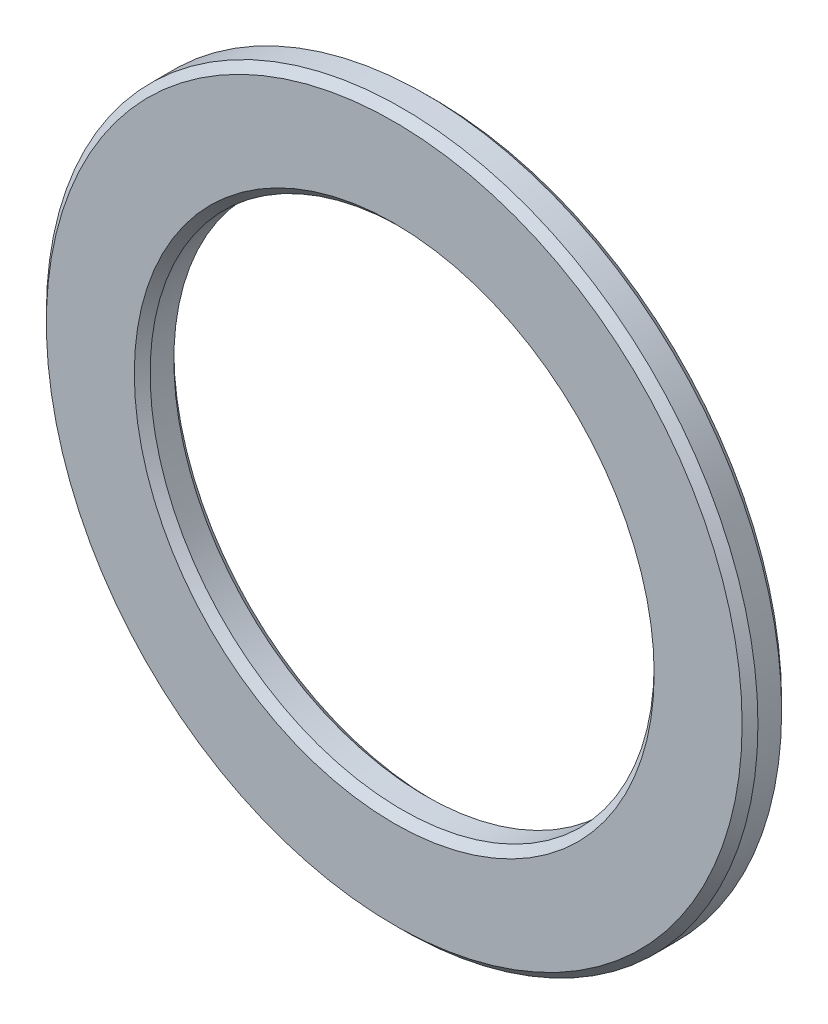
ISO-10303-21;
HEADER;
FILE_DESCRIPTION(('STEP AP214'),'2;1');
FILE_NAME('part.step','',(''),(''),'','','');
FILE_SCHEMA(('AUTOMOTIVE_DESIGN { 1 0 10303 214 1 1 1 1 }'));
ENDSEC;
DATA;
#1=APPLICATION_CONTEXT('core data for automotive mechanical design processes');
#2=APPLICATION_PROTOCOL_DEFINITION('international standard','automotive_design',2000,#1);
#3=PRODUCT_CONTEXT('',#1,'mechanical');
#4=PRODUCT('Part','Part','',(#3));
#5=PRODUCT_RELATED_PRODUCT_CATEGORY('part','',(#4));
#6=PRODUCT_DEFINITION_FORMATION('','',#4);
#7=PRODUCT_DEFINITION_CONTEXT('part definition',#1,'design');
#8=PRODUCT_DEFINITION('design','',#6,#7);
#9=PRODUCT_DEFINITION_SHAPE('','',#8);
#10=(LENGTH_UNIT() NAMED_UNIT(*) SI_UNIT(.MILLI.,.METRE.));
#11=(NAMED_UNIT(*) PLANE_ANGLE_UNIT() SI_UNIT($,.RADIAN.));
#12=(NAMED_UNIT(*) SI_UNIT($,.STERADIAN.) SOLID_ANGLE_UNIT());
#13=UNCERTAINTY_MEASURE_WITH_UNIT(LENGTH_MEASURE(1.E-05),#10,'distance_accuracy_value','');
#14=(GEOMETRIC_REPRESENTATION_CONTEXT(3) GLOBAL_UNCERTAINTY_ASSIGNED_CONTEXT((#13)) GLOBAL_UNIT_ASSIGNED_CONTEXT((#10,
#11,#12)) REPRESENTATION_CONTEXT('',''));
#15=CARTESIAN_POINT('',(0.,0.,0.));
#16=DIRECTION('',(0.,0.,1.));
#17=DIRECTION('',(1.,0.,0.));
#18=AXIS2_PLACEMENT_3D('',#15,#16,#17);
#19=CARTESIAN_POINT('',(0.,0.,1.));
#20=DIRECTION('',(0.,0.,1.));
#21=DIRECTION('',(1.,0.,0.));
#22=AXIS2_PLACEMENT_3D('',#19,#20,#21);
#23=PLANE('',#22);
#24=CARTESIAN_POINT('',(0.,0.,1.));
#25=DIRECTION('',(0.,0.,1.));
#26=DIRECTION('',(1.,0.,0.));
#27=AXIS2_PLACEMENT_3D('',#24,#25,#26);
#28=CIRCLE('',#27,17.6);
#29=CARTESIAN_POINT('',(17.6,0.,1.));
#30=VERTEX_POINT('',#29);
#31=EDGE_CURVE('E42',#30,#30,#28,.T.);
#32=ORIENTED_EDGE('',*,*,#31,.T.);
#33=EDGE_LOOP('',(#32));
#34=FACE_BOUND('',#33,.T.);
#35=CARTESIAN_POINT('',(0.,0.,1.));
#36=DIRECTION('',(0.,0.,1.));
#37=DIRECTION('',(1.,0.,0.));
#38=AXIS2_PLACEMENT_3D('',#35,#36,#37);
#39=CIRCLE('',#38,13.15);
#40=CARTESIAN_POINT('',(13.15,0.,1.));
#41=VERTEX_POINT('',#40);
#42=EDGE_CURVE('E46',#41,#41,#39,.F.);
#43=ORIENTED_EDGE('',*,*,#42,.T.);
#44=EDGE_LOOP('',(#43));
#45=FACE_BOUND('',#44,.T.);
#46=ADVANCED_FACE('F31',(#34,#45),#23,.T.);
#47=CARTESIAN_POINT('',(0.,0.,-1.));
#48=DIRECTION('',(0.,0.,1.));
#49=DIRECTION('',(1.,0.,0.));
#50=AXIS2_PLACEMENT_3D('',#47,#48,#49);
#51=PLANE('',#50);
#52=CARTESIAN_POINT('',(0.,0.,-1.));
#53=DIRECTION('',(0.,0.,1.));
#54=DIRECTION('',(1.,0.,0.));
#55=AXIS2_PLACEMENT_3D('',#52,#53,#54);
#56=CIRCLE('',#55,17.6);
#57=CARTESIAN_POINT('',(17.6,0.,-1.));
#58=VERTEX_POINT('',#57);
#59=EDGE_CURVE('E51',#58,#58,#56,.F.);
#60=ORIENTED_EDGE('',*,*,#59,.T.);
#61=EDGE_LOOP('',(#60));
#62=FACE_BOUND('',#61,.T.);
#63=CARTESIAN_POINT('',(0.,0.,-1.));
#64=DIRECTION('',(0.,0.,1.));
#65=DIRECTION('',(1.,0.,0.));
#66=AXIS2_PLACEMENT_3D('',#63,#64,#65);
#67=CIRCLE('',#66,13.15);
#68=CARTESIAN_POINT('',(13.15,0.,-1.));
#69=VERTEX_POINT('',#68);
#70=EDGE_CURVE('E54',#69,#69,#67,.T.);
#71=ORIENTED_EDGE('',*,*,#70,.T.);
#72=EDGE_LOOP('',(#71));
#73=FACE_BOUND('',#72,.T.);
#74=ADVANCED_FACE('F76',(#62,#73),#51,.F.);
#75=CARTESIAN_POINT('',(0.,0.,1.));
#76=DIRECTION('',(0.,0.,-1.));
#77=DIRECTION('',(-1.,0.,0.));
#78=AXIS2_PLACEMENT_3D('',#75,#76,#77);
#79=CYLINDRICAL_SURFACE('',#78,18.);
#80=CARTESIAN_POINT('',(0.,0.,-0.599999999999996));
#81=DIRECTION('',(0.,0.,1.));
#82=DIRECTION('',(1.,0.,0.));
#83=AXIS2_PLACEMENT_3D('',#80,#81,#82);
#84=CIRCLE('',#83,18.);
#85=CARTESIAN_POINT('',(18.,0.,-0.599999999999996));
#86=VERTEX_POINT('',#85);
#87=EDGE_CURVE('E57',#86,#86,#84,.T.);
#88=ORIENTED_EDGE('',*,*,#87,.T.);
#89=EDGE_LOOP('',(#88));
#90=FACE_BOUND('',#89,.T.);
#91=CARTESIAN_POINT('',(0.,0.,0.599999999999999));
#92=DIRECTION('',(0.,0.,1.));
#93=DIRECTION('',(1.,0.,0.));
#94=AXIS2_PLACEMENT_3D('',#91,#92,#93);
#95=CIRCLE('',#94,18.);
#96=CARTESIAN_POINT('',(18.,0.,0.599999999999999));
#97=VERTEX_POINT('',#96);
#98=EDGE_CURVE('E60',#97,#97,#95,.F.);
#99=ORIENTED_EDGE('',*,*,#98,.T.);
#100=EDGE_LOOP('',(#99));
#101=FACE_BOUND('',#100,.T.);
#102=ADVANCED_FACE('F64',(#90,#101),#79,.T.);
#103=CARTESIAN_POINT('',(0.,0.,1.));
#104=DIRECTION('',(0.,0.,-1.));
#105=DIRECTION('',(-1.,0.,0.));
#106=AXIS2_PLACEMENT_3D('',#103,#104,#105);
#107=CYLINDRICAL_SURFACE('',#106,12.75);
#108=CARTESIAN_POINT('',(0.,0.,-0.600000000000008));
#109=DIRECTION('',(0.,0.,1.));
#110=DIRECTION('',(1.,0.,0.));
#111=AXIS2_PLACEMENT_3D('',#108,#109,#110);
#112=CIRCLE('',#111,12.75);
#113=CARTESIAN_POINT('',(12.75,0.,-0.600000000000008));
#114=VERTEX_POINT('',#113);
#115=EDGE_CURVE('E10',#114,#114,#112,.F.);
#116=ORIENTED_EDGE('',*,*,#115,.T.);
#117=EDGE_LOOP('',(#116));
#118=FACE_BOUND('',#117,.T.);
#119=CARTESIAN_POINT('',(0.,0.,0.599999999999997));
#120=DIRECTION('',(0.,0.,1.));
#121=DIRECTION('',(1.,0.,0.));
#122=AXIS2_PLACEMENT_3D('',#119,#120,#121);
#123=CIRCLE('',#122,12.75);
#124=CARTESIAN_POINT('',(12.75,0.,0.599999999999997));
#125=VERTEX_POINT('',#124);
#126=EDGE_CURVE('E38',#125,#125,#123,.T.);
#127=ORIENTED_EDGE('',*,*,#126,.T.);
#128=EDGE_LOOP('',(#127));
#129=FACE_BOUND('',#128,.T.);
#130=ADVANCED_FACE('F92',(#118,#129),#107,.F.);
#131=CARTESIAN_POINT('',(0.,0.,-0.599999999999996));
#132=DIRECTION('',(0.,0.,1.));
#133=DIRECTION('',(1.,0.,0.));
#134=AXIS2_PLACEMENT_3D('',#131,#132,#133);
#135=CONICAL_SURFACE('',#134,18.,0.785398163397448);
#136=ORIENTED_EDGE('',*,*,#59,.F.);
#137=EDGE_LOOP('',(#136));
#138=FACE_BOUND('',#137,.T.);
#139=ORIENTED_EDGE('',*,*,#87,.F.);
#140=EDGE_LOOP('',(#139));
#141=FACE_BOUND('',#140,.T.);
#142=ADVANCED_FACE('F70',(#138,#141),#135,.T.);
#143=CARTESIAN_POINT('',(0.,0.,1.));
#144=DIRECTION('',(0.,0.,-1.));
#145=DIRECTION('',(-1.,0.,0.));
#146=AXIS2_PLACEMENT_3D('',#143,#144,#145);
#147=CONICAL_SURFACE('',#146,17.6,0.785398163397457);
#148=ORIENTED_EDGE('',*,*,#98,.F.);
#149=EDGE_LOOP('',(#148));
#150=FACE_BOUND('',#149,.T.);
#151=ORIENTED_EDGE('',*,*,#31,.F.);
#152=EDGE_LOOP('',(#151));
#153=FACE_BOUND('',#152,.T.);
#154=ADVANCED_FACE('F66',(#150,#153),#147,.T.);
#155=CARTESIAN_POINT('',(0.,0.,-1.));
#156=DIRECTION('',(0.,0.,-1.));
#157=DIRECTION('',(-1.,0.,0.));
#158=AXIS2_PLACEMENT_3D('',#155,#156,#157);
#159=CONICAL_SURFACE('',#158,13.15,0.785398163397446);
#160=ORIENTED_EDGE('',*,*,#115,.F.);
#161=EDGE_LOOP('',(#160));
#162=FACE_BOUND('',#161,.T.);
#163=ORIENTED_EDGE('',*,*,#70,.F.);
#164=EDGE_LOOP('',(#163));
#165=FACE_BOUND('',#164,.T.);
#166=ADVANCED_FACE('F69',(#162,#165),#159,.F.);
#167=CARTESIAN_POINT('',(0.,0.,0.599999999999997));
#168=DIRECTION('',(0.,0.,1.));
#169=DIRECTION('',(1.,0.,0.));
#170=AXIS2_PLACEMENT_3D('',#167,#168,#169);
#171=CONICAL_SURFACE('',#170,12.75,0.785398163397442);
#172=ORIENTED_EDGE('',*,*,#42,.F.);
#173=EDGE_LOOP('',(#172));
#174=FACE_BOUND('',#173,.T.);
#175=ORIENTED_EDGE('',*,*,#126,.F.);
#176=EDGE_LOOP('',(#175));
#177=FACE_BOUND('',#176,.T.);
#178=ADVANCED_FACE('F33',(#174,#177),#171,.F.);
#179=CLOSED_SHELL('',(#46,#74,#102,#130,#142,#154,#166,#178));
#180=MANIFOLD_SOLID_BREP('B2',#179);
#181=ADVANCED_BREP_SHAPE_REPRESENTATION('',(#18,#180),#14);
#182=SHAPE_DEFINITION_REPRESENTATION(#9,#181);
ENDSEC;
END-ISO-10303-21;
